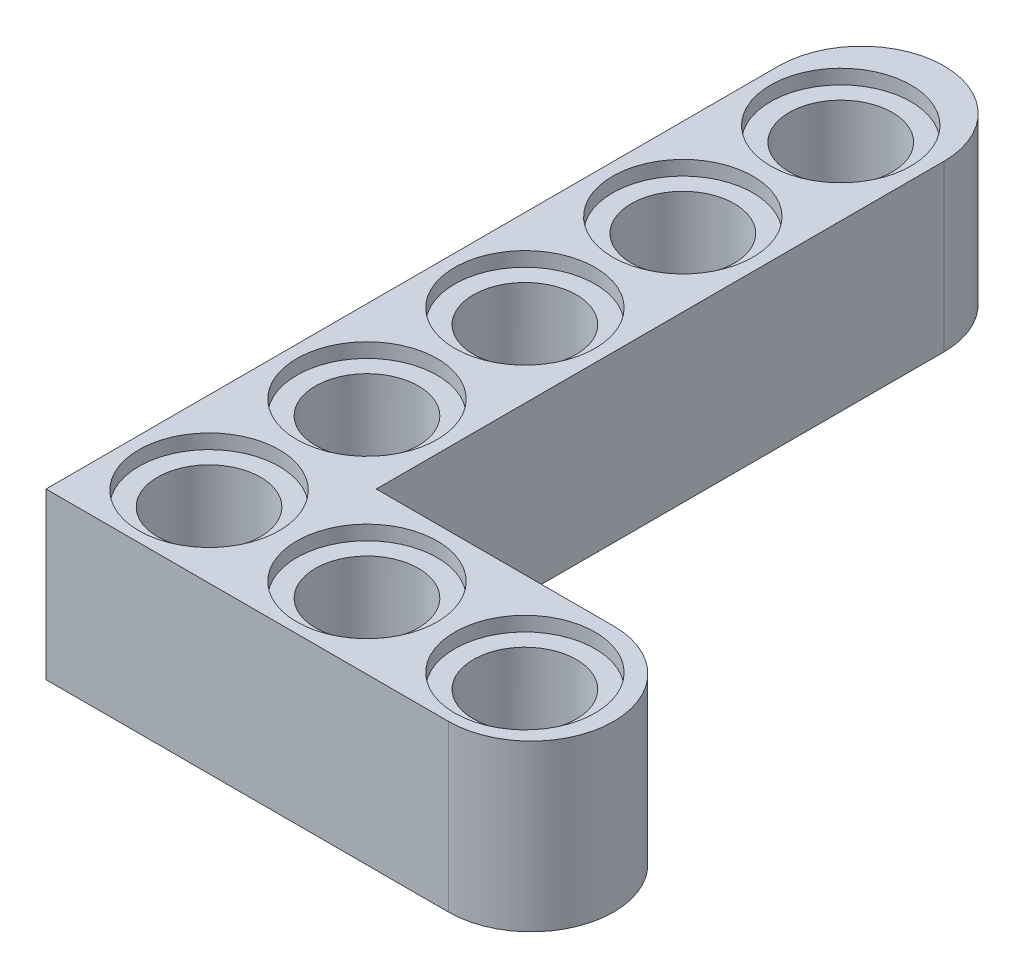
ISO-10303-21;
HEADER;
FILE_DESCRIPTION(('STEP AP214'),'2;1');
FILE_NAME('part.step','',(''),(''),'','','');
FILE_SCHEMA(('AUTOMOTIVE_DESIGN { 1 0 10303 214 1 1 1 1 }'));
ENDSEC;
DATA;
#1=APPLICATION_CONTEXT('core data for automotive mechanical design processes');
#2=APPLICATION_PROTOCOL_DEFINITION('international standard','automotive_design',2000,#1);
#3=PRODUCT_CONTEXT('',#1,'mechanical');
#4=PRODUCT('Part','Part','',(#3));
#5=PRODUCT_RELATED_PRODUCT_CATEGORY('part','',(#4));
#6=PRODUCT_DEFINITION_FORMATION('','',#4);
#7=PRODUCT_DEFINITION_CONTEXT('part definition',#1,'design');
#8=PRODUCT_DEFINITION('design','',#6,#7);
#9=PRODUCT_DEFINITION_SHAPE('','',#8);
#10=(LENGTH_UNIT() NAMED_UNIT(*) SI_UNIT(.MILLI.,.METRE.));
#11=(NAMED_UNIT(*) PLANE_ANGLE_UNIT() SI_UNIT($,.RADIAN.));
#12=(NAMED_UNIT(*) SI_UNIT($,.STERADIAN.) SOLID_ANGLE_UNIT());
#13=UNCERTAINTY_MEASURE_WITH_UNIT(LENGTH_MEASURE(1.E-05),#10,'distance_accuracy_value','');
#14=(GEOMETRIC_REPRESENTATION_CONTEXT(3) GLOBAL_UNCERTAINTY_ASSIGNED_CONTEXT((#13)) GLOBAL_UNIT_ASSIGNED_CONTEXT((#10,
#11,#12)) REPRESENTATION_CONTEXT('',''));
#15=CARTESIAN_POINT('',(0.,0.,0.));
#16=DIRECTION('',(0.,0.,1.));
#17=DIRECTION('',(1.,0.,0.));
#18=AXIS2_PLACEMENT_3D('',#15,#16,#17);
#19=CARTESIAN_POINT('',(11.5,8.,4.));
#20=DIRECTION('',(0.,-1.,0.));
#21=DIRECTION('',(0.,0.,-1.));
#22=AXIS2_PLACEMENT_3D('',#19,#20,#21);
#23=CYLINDRICAL_SURFACE('',#22,4.);
#24=DIRECTION('',(0.,-1.,0.));
#25=VECTOR('',#24,1.);
#26=CARTESIAN_POINT('',(11.5,8.,0.));
#27=LINE('',#26,#25);
#28=CARTESIAN_POINT('',(11.5,8.,0.));
#29=VERTEX_POINT('',#28);
#30=CARTESIAN_POINT('',(11.5,0.,0.));
#31=VERTEX_POINT('',#30);
#32=EDGE_CURVE('E178',#29,#31,#27,.T.);
#33=ORIENTED_EDGE('',*,*,#32,.F.);
#34=CARTESIAN_POINT('',(11.5,8.,4.));
#35=DIRECTION('',(0.,-1.,0.));
#36=DIRECTION('',(0.,0.,-1.));
#37=AXIS2_PLACEMENT_3D('',#34,#35,#36);
#38=CIRCLE('',#37,4.);
#39=CARTESIAN_POINT('',(11.5,8.,8.));
#40=VERTEX_POINT('',#39);
#41=EDGE_CURVE('E43',#40,#29,#38,.F.);
#42=ORIENTED_EDGE('',*,*,#41,.F.);
#43=DIRECTION('',(0.,-1.,0.));
#44=VECTOR('',#43,1.);
#45=CARTESIAN_POINT('',(11.5,8.,8.));
#46=LINE('',#45,#44);
#47=CARTESIAN_POINT('',(11.5,0.,8.));
#48=VERTEX_POINT('',#47);
#49=EDGE_CURVE('E109',#48,#40,#46,.F.);
#50=ORIENTED_EDGE('',*,*,#49,.F.);
#51=CARTESIAN_POINT('',(11.5,0.,4.));
#52=DIRECTION('',(0.,-1.,0.));
#53=DIRECTION('',(0.,0.,-1.));
#54=AXIS2_PLACEMENT_3D('',#51,#52,#53);
#55=CIRCLE('',#54,4.);
#56=EDGE_CURVE('E11',#31,#48,#55,.T.);
#57=ORIENTED_EDGE('',*,*,#56,.F.);
#58=EDGE_LOOP('',(#33,#42,#50,#57));
#59=FACE_BOUND('',#58,.T.);
#60=ADVANCED_FACE('F35',(#59),#23,.T.);
#61=CARTESIAN_POINT('',(-4.,0.,-27.5));
#62=DIRECTION('',(0.,-1.,0.));
#63=DIRECTION('',(0.,0.,-1.));
#64=AXIS2_PLACEMENT_3D('',#61,#62,#63);
#65=CYLINDRICAL_SURFACE('',#64,4.);
#66=DIRECTION('',(0.,-1.,0.));
#67=VECTOR('',#66,1.);
#68=CARTESIAN_POINT('',(0.,8.,-27.5));
#69=LINE('',#68,#67);
#70=CARTESIAN_POINT('',(0.,0.,-27.5));
#71=VERTEX_POINT('',#70);
#72=CARTESIAN_POINT('',(0.,8.,-27.5));
#73=VERTEX_POINT('',#72);
#74=EDGE_CURVE('E105',#71,#73,#69,.F.);
#75=ORIENTED_EDGE('',*,*,#74,.F.);
#76=CARTESIAN_POINT('',(-4.,0.,-27.5));
#77=DIRECTION('',(0.,-1.,0.));
#78=DIRECTION('',(0.,0.,-1.));
#79=AXIS2_PLACEMENT_3D('',#76,#77,#78);
#80=CIRCLE('',#79,4.);
#81=CARTESIAN_POINT('',(-8.,0.,-27.5));
#82=VERTEX_POINT('',#81);
#83=EDGE_CURVE('E175',#82,#71,#80,.T.);
#84=ORIENTED_EDGE('',*,*,#83,.F.);
#85=DIRECTION('',(0.,-1.,0.));
#86=VECTOR('',#85,1.);
#87=CARTESIAN_POINT('',(-8.,8.,-27.5));
#88=LINE('',#87,#86);
#89=CARTESIAN_POINT('',(-8.,8.,-27.5));
#90=VERTEX_POINT('',#89);
#91=EDGE_CURVE('E173',#90,#82,#88,.T.);
#92=ORIENTED_EDGE('',*,*,#91,.F.);
#93=CARTESIAN_POINT('',(-4.,8.,-27.5));
#94=DIRECTION('',(0.,-1.,0.));
#95=DIRECTION('',(0.,0.,-1.));
#96=AXIS2_PLACEMENT_3D('',#93,#94,#95);
#97=CIRCLE('',#96,4.);
#98=EDGE_CURVE('E92',#73,#90,#97,.F.);
#99=ORIENTED_EDGE('',*,*,#98,.F.);
#100=EDGE_LOOP('',(#75,#84,#92,#99));
#101=FACE_BOUND('',#100,.T.);
#102=ADVANCED_FACE('F191',(#101),#65,.T.);
#103=CARTESIAN_POINT('',(11.3000000000004,0.,4.10186368983272));
#104=DIRECTION('',(0.,1.,0.));
#105=DIRECTION('',(0.,0.,1.));
#106=AXIS2_PLACEMENT_3D('',#103,#104,#105);
#107=CYLINDRICAL_SURFACE('',#106,2.49663070763019);
#108=CARTESIAN_POINT('',(11.3000000000004,7.3,4.10186368983272));
#109=DIRECTION('',(0.,1.,0.));
#110=DIRECTION('',(0.,0.,1.));
#111=AXIS2_PLACEMENT_3D('',#108,#109,#110);
#112=CIRCLE('',#111,2.49663070763019);
#113=CARTESIAN_POINT('',(11.3000000000004,7.3,6.59849439746291));
#114=VERTEX_POINT('',#113);
#115=EDGE_CURVE('E119',#114,#114,#112,.F.);
#116=ORIENTED_EDGE('',*,*,#115,.F.);
#117=EDGE_LOOP('',(#116));
#118=FACE_BOUND('',#117,.T.);
#119=CARTESIAN_POINT('',(11.3000000000004,0.7,4.10186368983272));
#120=DIRECTION('',(0.,-1.,0.));
#121=DIRECTION('',(0.,0.,-1.));
#122=AXIS2_PLACEMENT_3D('',#119,#120,#121);
#123=CIRCLE('',#122,2.49663070763019);
#124=CARTESIAN_POINT('',(11.3000000000004,0.7,1.60523298220252));
#125=VERTEX_POINT('',#124);
#126=EDGE_CURVE('E167',#125,#125,#123,.F.);
#127=ORIENTED_EDGE('',*,*,#126,.F.);
#128=EDGE_LOOP('',(#127));
#129=FACE_BOUND('',#128,.T.);
#130=ADVANCED_FACE('F213',(#118,#129),#107,.F.);
#131=CARTESIAN_POINT('',(3.65000000000044,0.,4.10186368983272));
#132=DIRECTION('',(0.,1.,0.));
#133=DIRECTION('',(0.,0.,1.));
#134=AXIS2_PLACEMENT_3D('',#131,#132,#133);
#135=CYLINDRICAL_SURFACE('',#134,2.49663070763019);
#136=CARTESIAN_POINT('',(3.65000000000044,7.3,4.10186368983272));
#137=DIRECTION('',(0.,1.,0.));
#138=DIRECTION('',(0.,0.,1.));
#139=AXIS2_PLACEMENT_3D('',#136,#137,#138);
#140=CIRCLE('',#139,2.49663070763019);
#141=CARTESIAN_POINT('',(3.65000000000044,7.3,6.59849439746291));
#142=VERTEX_POINT('',#141);
#143=EDGE_CURVE('E143',#142,#142,#140,.F.);
#144=ORIENTED_EDGE('',*,*,#143,.F.);
#145=EDGE_LOOP('',(#144));
#146=FACE_BOUND('',#145,.T.);
#147=CARTESIAN_POINT('',(3.65000000000044,0.7,4.10186368983272));
#148=DIRECTION('',(0.,-1.,0.));
#149=DIRECTION('',(0.,0.,-1.));
#150=AXIS2_PLACEMENT_3D('',#147,#148,#149);
#151=CIRCLE('',#150,2.49663070763019);
#152=CARTESIAN_POINT('',(3.65000000000044,0.7,1.60523298220252));
#153=VERTEX_POINT('',#152);
#154=EDGE_CURVE('E164',#153,#153,#151,.F.);
#155=ORIENTED_EDGE('',*,*,#154,.F.);
#156=EDGE_LOOP('',(#155));
#157=FACE_BOUND('',#156,.T.);
#158=ADVANCED_FACE('F217',(#146,#157),#135,.F.);
#159=CARTESIAN_POINT('',(-3.99999999999956,0.,4.10186368983272));
#160=DIRECTION('',(0.,1.,0.));
#161=DIRECTION('',(0.,0.,1.));
#162=AXIS2_PLACEMENT_3D('',#159,#160,#161);
#163=CYLINDRICAL_SURFACE('',#162,2.49663070763019);
#164=CARTESIAN_POINT('',(-3.99999999999956,7.3,4.10186368983272));
#165=DIRECTION('',(0.,1.,0.));
#166=DIRECTION('',(0.,0.,1.));
#167=AXIS2_PLACEMENT_3D('',#164,#165,#166);
#168=CIRCLE('',#167,2.49663070763019);
#169=CARTESIAN_POINT('',(-3.99999999999956,7.3,6.59849439746291));
#170=VERTEX_POINT('',#169);
#171=EDGE_CURVE('E140',#170,#170,#168,.F.);
#172=ORIENTED_EDGE('',*,*,#171,.F.);
#173=EDGE_LOOP('',(#172));
#174=FACE_BOUND('',#173,.T.);
#175=CARTESIAN_POINT('',(-3.99999999999956,0.7,4.10186368983272));
#176=DIRECTION('',(0.,-1.,0.));
#177=DIRECTION('',(0.,0.,-1.));
#178=AXIS2_PLACEMENT_3D('',#175,#176,#177);
#179=CIRCLE('',#178,2.49663070763019);
#180=CARTESIAN_POINT('',(-3.99999999999956,0.7,1.60523298220252));
#181=VERTEX_POINT('',#180);
#182=EDGE_CURVE('E161',#181,#181,#179,.F.);
#183=ORIENTED_EDGE('',*,*,#182,.F.);
#184=EDGE_LOOP('',(#183));
#185=FACE_BOUND('',#184,.T.);
#186=ADVANCED_FACE('F408',(#174,#185),#163,.F.);
#187=CARTESIAN_POINT('',(-3.99999999999978,0.,-3.54813631016728));
#188=DIRECTION('',(0.,1.,0.));
#189=DIRECTION('',(0.,0.,1.));
#190=AXIS2_PLACEMENT_3D('',#187,#188,#189);
#191=CYLINDRICAL_SURFACE('',#190,2.49663070763019);
#192=CARTESIAN_POINT('',(-3.99999999999978,7.3,-3.54813631016728));
#193=DIRECTION('',(0.,1.,0.));
#194=DIRECTION('',(0.,0.,1.));
#195=AXIS2_PLACEMENT_3D('',#192,#193,#194);
#196=CIRCLE('',#195,2.49663070763019);
#197=CARTESIAN_POINT('',(-3.99999999999978,7.3,-1.05150560253709));
#198=VERTEX_POINT('',#197);
#199=EDGE_CURVE('E137',#198,#198,#196,.F.);
#200=ORIENTED_EDGE('',*,*,#199,.F.);
#201=EDGE_LOOP('',(#200));
#202=FACE_BOUND('',#201,.T.);
#203=CARTESIAN_POINT('',(-3.99999999999978,0.7,-3.54813631016728));
#204=DIRECTION('',(0.,-1.,0.));
#205=DIRECTION('',(0.,0.,-1.));
#206=AXIS2_PLACEMENT_3D('',#203,#204,#205);
#207=CIRCLE('',#206,2.49663070763019);
#208=CARTESIAN_POINT('',(-3.99999999999978,0.7,-6.04476701779748));
#209=VERTEX_POINT('',#208);
#210=EDGE_CURVE('E158',#209,#209,#207,.F.);
#211=ORIENTED_EDGE('',*,*,#210,.F.);
#212=EDGE_LOOP('',(#211));
#213=FACE_BOUND('',#212,.T.);
#214=ADVANCED_FACE('F399',(#202,#213),#191,.F.);
#215=CARTESIAN_POINT('',(-3.99999999999999,0.,-11.1981363101673));
#216=DIRECTION('',(0.,1.,0.));
#217=DIRECTION('',(0.,0.,1.));
#218=AXIS2_PLACEMENT_3D('',#215,#216,#217);
#219=CYLINDRICAL_SURFACE('',#218,2.49663070763019);
#220=CARTESIAN_POINT('',(-3.99999999999999,7.3,-11.1981363101673));
#221=DIRECTION('',(0.,1.,0.));
#222=DIRECTION('',(0.,0.,1.));
#223=AXIS2_PLACEMENT_3D('',#220,#221,#222);
#224=CIRCLE('',#223,2.49663070763019);
#225=CARTESIAN_POINT('',(-3.99999999999999,7.3,-8.70150560253709));
#226=VERTEX_POINT('',#225);
#227=EDGE_CURVE('E134',#226,#226,#224,.F.);
#228=ORIENTED_EDGE('',*,*,#227,.F.);
#229=EDGE_LOOP('',(#228));
#230=FACE_BOUND('',#229,.T.);
#231=CARTESIAN_POINT('',(-3.99999999999999,0.7,-11.1981363101673));
#232=DIRECTION('',(0.,-1.,0.));
#233=DIRECTION('',(0.,0.,-1.));
#234=AXIS2_PLACEMENT_3D('',#231,#232,#233);
#235=CIRCLE('',#234,2.49663070763019);
#236=CARTESIAN_POINT('',(-3.99999999999999,0.7,-13.6947670177975));
#237=VERTEX_POINT('',#236);
#238=EDGE_CURVE('E155',#237,#237,#235,.F.);
#239=ORIENTED_EDGE('',*,*,#238,.F.);
#240=EDGE_LOOP('',(#239));
#241=FACE_BOUND('',#240,.T.);
#242=ADVANCED_FACE('F390',(#230,#241),#219,.F.);
#243=CARTESIAN_POINT('',(-4.00000000000021,0.,-18.8481363101673));
#244=DIRECTION('',(0.,1.,0.));
#245=DIRECTION('',(0.,0.,1.));
#246=AXIS2_PLACEMENT_3D('',#243,#244,#245);
#247=CYLINDRICAL_SURFACE('',#246,2.49663070763019);
#248=CARTESIAN_POINT('',(-4.00000000000021,7.3,-18.8481363101673));
#249=DIRECTION('',(0.,1.,0.));
#250=DIRECTION('',(0.,0.,1.));
#251=AXIS2_PLACEMENT_3D('',#248,#249,#250);
#252=CIRCLE('',#251,2.49663070763019);
#253=CARTESIAN_POINT('',(-4.00000000000021,7.3,-16.3515056025371));
#254=VERTEX_POINT('',#253);
#255=EDGE_CURVE('E130',#254,#254,#252,.F.);
#256=ORIENTED_EDGE('',*,*,#255,.F.);
#257=EDGE_LOOP('',(#256));
#258=FACE_BOUND('',#257,.T.);
#259=CARTESIAN_POINT('',(-4.00000000000021,0.7,-18.8481363101673));
#260=DIRECTION('',(0.,-1.,0.));
#261=DIRECTION('',(0.,0.,-1.));
#262=AXIS2_PLACEMENT_3D('',#259,#260,#261);
#263=CIRCLE('',#262,2.49663070763019);
#264=CARTESIAN_POINT('',(-4.00000000000021,0.7,-21.3447670177975));
#265=VERTEX_POINT('',#264);
#266=EDGE_CURVE('E151',#265,#265,#263,.F.);
#267=ORIENTED_EDGE('',*,*,#266,.F.);
#268=EDGE_LOOP('',(#267));
#269=FACE_BOUND('',#268,.T.);
#270=ADVANCED_FACE('F380',(#258,#269),#247,.F.);
#271=CARTESIAN_POINT('',(-4.00000000000042,0.,-26.4981363101673));
#272=DIRECTION('',(0.,1.,0.));
#273=DIRECTION('',(0.,0.,1.));
#274=AXIS2_PLACEMENT_3D('',#271,#272,#273);
#275=CYLINDRICAL_SURFACE('',#274,2.49663070763019);
#276=CARTESIAN_POINT('',(-4.00000000000042,7.3,-26.4981363101673));
#277=DIRECTION('',(0.,1.,0.));
#278=DIRECTION('',(0.,0.,1.));
#279=AXIS2_PLACEMENT_3D('',#276,#277,#278);
#280=CIRCLE('',#279,2.49663070763019);
#281=CARTESIAN_POINT('',(-4.00000000000042,7.3,-24.0015056025371));
#282=VERTEX_POINT('',#281);
#283=EDGE_CURVE('E127',#282,#282,#280,.F.);
#284=ORIENTED_EDGE('',*,*,#283,.F.);
#285=EDGE_LOOP('',(#284));
#286=FACE_BOUND('',#285,.T.);
#287=CARTESIAN_POINT('',(-4.00000000000042,0.7,-26.4981363101673));
#288=DIRECTION('',(0.,-1.,0.));
#289=DIRECTION('',(0.,0.,-1.));
#290=AXIS2_PLACEMENT_3D('',#287,#288,#289);
#291=CIRCLE('',#290,2.49663070763019);
#292=CARTESIAN_POINT('',(-4.00000000000042,0.7,-28.9947670177975));
#293=VERTEX_POINT('',#292);
#294=EDGE_CURVE('E148',#293,#293,#291,.F.);
#295=ORIENTED_EDGE('',*,*,#294,.F.);
#296=EDGE_LOOP('',(#295));
#297=FACE_BOUND('',#296,.T.);
#298=ADVANCED_FACE('F226',(#286,#297),#275,.F.);
#299=CARTESIAN_POINT('',(-8.00000000000001,8.,8.00000000000001));
#300=DIRECTION('',(1.,0.,0.));
#301=DIRECTION('',(0.,0.,-1.));
#302=AXIS2_PLACEMENT_3D('',#299,#300,#301);
#303=PLANE('',#302);
#304=DIRECTION('',(0.,0.,1.));
#305=VECTOR('',#304,1.);
#306=CARTESIAN_POINT('',(-8.00000000000001,8.,8.00000000000001));
#307=LINE('',#306,#305);
#308=CARTESIAN_POINT('',(-8.00000000000001,8.,8.00000000000001));
#309=VERTEX_POINT('',#308);
#310=EDGE_CURVE('E86',#90,#309,#307,.T.);
#311=ORIENTED_EDGE('',*,*,#310,.F.);
#312=ORIENTED_EDGE('',*,*,#91,.T.);
#313=DIRECTION('',(0.,0.,1.));
#314=VECTOR('',#313,1.);
#315=CARTESIAN_POINT('',(-8.00000000000001,0.,8.00000000000001));
#316=LINE('',#315,#314);
#317=CARTESIAN_POINT('',(-8.00000000000001,0.,8.00000000000001));
#318=VERTEX_POINT('',#317);
#319=EDGE_CURVE('E102',#82,#318,#316,.T.);
#320=ORIENTED_EDGE('',*,*,#319,.T.);
#321=DIRECTION('',(0.,-1.,0.));
#322=VECTOR('',#321,1.);
#323=CARTESIAN_POINT('',(-8.00000000000001,8.,8.00000000000001));
#324=LINE('',#323,#322);
#325=EDGE_CURVE('E99',#309,#318,#324,.T.);
#326=ORIENTED_EDGE('',*,*,#325,.F.);
#327=EDGE_LOOP('',(#311,#312,#320,#326));
#328=FACE_BOUND('',#327,.T.);
#329=ADVANCED_FACE('F100',(#328),#303,.F.);
#330=CARTESIAN_POINT('',(15.5,8.,8.));
#331=DIRECTION('',(0.,0.,-1.));
#332=DIRECTION('',(-1.,0.,0.));
#333=AXIS2_PLACEMENT_3D('',#330,#331,#332);
#334=PLANE('',#333);
#335=DIRECTION('',(1.,0.,0.));
#336=VECTOR('',#335,1.);
#337=CARTESIAN_POINT('',(15.5,0.,8.));
#338=LINE('',#337,#336);
#339=EDGE_CURVE('E118',#318,#48,#338,.T.);
#340=ORIENTED_EDGE('',*,*,#339,.T.);
#341=ORIENTED_EDGE('',*,*,#49,.T.);
#342=DIRECTION('',(1.,0.,0.));
#343=VECTOR('',#342,1.);
#344=CARTESIAN_POINT('',(15.5,8.,8.));
#345=LINE('',#344,#343);
#346=EDGE_CURVE('E90',#309,#40,#345,.T.);
#347=ORIENTED_EDGE('',*,*,#346,.F.);
#348=ORIENTED_EDGE('',*,*,#325,.T.);
#349=EDGE_LOOP('',(#340,#341,#347,#348));
#350=FACE_BOUND('',#349,.T.);
#351=ADVANCED_FACE('F108',(#350),#334,.F.);
#352=CARTESIAN_POINT('',(0.,8.,0.));
#353=DIRECTION('',(0.,0.,1.));
#354=DIRECTION('',(1.,0.,0.));
#355=AXIS2_PLACEMENT_3D('',#352,#353,#354);
#356=PLANE('',#355);
#357=DIRECTION('',(-1.,0.,0.));
#358=VECTOR('',#357,1.);
#359=CARTESIAN_POINT('',(0.,8.,0.));
#360=LINE('',#359,#358);
#361=CARTESIAN_POINT('',(0.,8.,0.));
#362=VERTEX_POINT('',#361);
#363=EDGE_CURVE('E110',#29,#362,#360,.T.);
#364=ORIENTED_EDGE('',*,*,#363,.F.);
#365=ORIENTED_EDGE('',*,*,#32,.T.);
#366=DIRECTION('',(-1.,0.,0.));
#367=VECTOR('',#366,1.);
#368=CARTESIAN_POINT('',(0.,0.,0.));
#369=LINE('',#368,#367);
#370=CARTESIAN_POINT('',(0.,0.,0.));
#371=VERTEX_POINT('',#370);
#372=EDGE_CURVE('E121',#31,#371,#369,.T.);
#373=ORIENTED_EDGE('',*,*,#372,.T.);
#374=DIRECTION('',(0.,-1.,0.));
#375=VECTOR('',#374,1.);
#376=CARTESIAN_POINT('',(0.,8.,0.));
#377=LINE('',#376,#375);
#378=EDGE_CURVE('E106',#362,#371,#377,.T.);
#379=ORIENTED_EDGE('',*,*,#378,.F.);
#380=EDGE_LOOP('',(#364,#365,#373,#379));
#381=FACE_BOUND('',#380,.T.);
#382=ADVANCED_FACE('F184',(#381),#356,.F.);
#383=CARTESIAN_POINT('',(0.,8.,-31.5));
#384=DIRECTION('',(-1.,0.,0.));
#385=DIRECTION('',(0.,0.,1.));
#386=AXIS2_PLACEMENT_3D('',#383,#384,#385);
#387=PLANE('',#386);
#388=DIRECTION('',(0.,0.,-1.));
#389=VECTOR('',#388,1.);
#390=CARTESIAN_POINT('',(0.,0.,-31.5));
#391=LINE('',#390,#389);
#392=EDGE_CURVE('E96',#371,#71,#391,.T.);
#393=ORIENTED_EDGE('',*,*,#392,.T.);
#394=ORIENTED_EDGE('',*,*,#74,.T.);
#395=DIRECTION('',(0.,0.,-1.));
#396=VECTOR('',#395,1.);
#397=CARTESIAN_POINT('',(0.,8.,-31.5));
#398=LINE('',#397,#396);
#399=EDGE_CURVE('E112',#362,#73,#398,.T.);
#400=ORIENTED_EDGE('',*,*,#399,.F.);
#401=ORIENTED_EDGE('',*,*,#378,.T.);
#402=EDGE_LOOP('',(#393,#394,#400,#401));
#403=FACE_BOUND('',#402,.T.);
#404=ADVANCED_FACE('F188',(#403),#387,.F.);
#405=CARTESIAN_POINT('',(0.,8.,0.));
#406=DIRECTION('',(0.,-1.,0.));
#407=DIRECTION('',(0.,0.,-1.));
#408=AXIS2_PLACEMENT_3D('',#405,#406,#407);
#409=PLANE('',#408);
#410=CARTESIAN_POINT('',(-4.00000000000042,8.,-26.4981363101673));
#411=DIRECTION('',(0.,1.,0.));
#412=DIRECTION('',(0.,0.,1.));
#413=AXIS2_PLACEMENT_3D('',#410,#411,#412);
#414=CIRCLE('',#413,3.4);
#415=CARTESIAN_POINT('',(-4.00000000000042,8.,-23.0981363101673));
#416=VERTEX_POINT('',#415);
#417=EDGE_CURVE('E631',#416,#416,#414,.T.);
#418=ORIENTED_EDGE('',*,*,#417,.F.);
#419=EDGE_LOOP('',(#418));
#420=FACE_BOUND('',#419,.T.);
#421=CARTESIAN_POINT('',(-4.0000000000001,8.,-18.8481363101673));
#422=DIRECTION('',(0.,1.,0.));
#423=DIRECTION('',(0.,0.,1.));
#424=AXIS2_PLACEMENT_3D('',#421,#422,#423);
#425=CIRCLE('',#424,3.4);
#426=CARTESIAN_POINT('',(-4.0000000000001,8.,-15.4481363101673));
#427=VERTEX_POINT('',#426);
#428=EDGE_CURVE('E637',#427,#427,#425,.T.);
#429=ORIENTED_EDGE('',*,*,#428,.F.);
#430=EDGE_LOOP('',(#429));
#431=FACE_BOUND('',#430,.T.);
#432=CARTESIAN_POINT('',(-3.99999999999977,8.,-11.1981363101673));
#433=DIRECTION('',(0.,1.,0.));
#434=DIRECTION('',(0.,0.,1.));
#435=AXIS2_PLACEMENT_3D('',#432,#433,#434);
#436=CIRCLE('',#435,3.4);
#437=CARTESIAN_POINT('',(-3.99999999999977,8.,-7.79813631016729));
#438=VERTEX_POINT('',#437);
#439=EDGE_CURVE('E643',#438,#438,#436,.T.);
#440=ORIENTED_EDGE('',*,*,#439,.F.);
#441=EDGE_LOOP('',(#440));
#442=FACE_BOUND('',#441,.T.);
#443=CARTESIAN_POINT('',(-3.99999999999945,8.,-3.54813631016728));
#444=DIRECTION('',(0.,1.,0.));
#445=DIRECTION('',(0.,0.,1.));
#446=AXIS2_PLACEMENT_3D('',#443,#444,#445);
#447=CIRCLE('',#446,3.4);
#448=CARTESIAN_POINT('',(-3.99999999999945,8.,-0.148136310167285));
#449=VERTEX_POINT('',#448);
#450=EDGE_CURVE('E649',#449,#449,#447,.T.);
#451=ORIENTED_EDGE('',*,*,#450,.F.);
#452=EDGE_LOOP('',(#451));
#453=FACE_BOUND('',#452,.T.);
#454=CARTESIAN_POINT('',(-3.99999999999913,8.,4.10186368983272));
#455=DIRECTION('',(0.,1.,0.));
#456=DIRECTION('',(0.,0.,1.));
#457=AXIS2_PLACEMENT_3D('',#454,#455,#456);
#458=CIRCLE('',#457,3.4);
#459=CARTESIAN_POINT('',(-3.99999999999913,8.,7.50186368983272));
#460=VERTEX_POINT('',#459);
#461=EDGE_CURVE('E655',#460,#460,#458,.T.);
#462=ORIENTED_EDGE('',*,*,#461,.F.);
#463=EDGE_LOOP('',(#462));
#464=FACE_BOUND('',#463,.T.);
#465=CARTESIAN_POINT('',(3.65000000000044,8.,4.10186368983272));
#466=DIRECTION('',(0.,1.,0.));
#467=DIRECTION('',(0.,0.,1.));
#468=AXIS2_PLACEMENT_3D('',#465,#466,#467);
#469=CIRCLE('',#468,3.4);
#470=CARTESIAN_POINT('',(3.65000000000044,8.,7.50186368983272));
#471=VERTEX_POINT('',#470);
#472=EDGE_CURVE('E661',#471,#471,#469,.T.);
#473=ORIENTED_EDGE('',*,*,#472,.F.);
#474=EDGE_LOOP('',(#473));
#475=FACE_BOUND('',#474,.T.);
#476=CARTESIAN_POINT('',(11.3,8.,4.10186368983272));
#477=DIRECTION('',(0.,1.,0.));
#478=DIRECTION('',(0.,0.,1.));
#479=AXIS2_PLACEMENT_3D('',#476,#477,#478);
#480=CIRCLE('',#479,3.4);
#481=CARTESIAN_POINT('',(11.3,8.,7.50186368983272));
#482=VERTEX_POINT('',#481);
#483=EDGE_CURVE('E170',#482,#482,#480,.T.);
#484=ORIENTED_EDGE('',*,*,#483,.F.);
#485=EDGE_LOOP('',(#484));
#486=FACE_BOUND('',#485,.T.);
#487=ORIENTED_EDGE('',*,*,#346,.T.);
#488=ORIENTED_EDGE('',*,*,#41,.T.);
#489=ORIENTED_EDGE('',*,*,#363,.T.);
#490=ORIENTED_EDGE('',*,*,#399,.T.);
#491=ORIENTED_EDGE('',*,*,#98,.T.);
#492=ORIENTED_EDGE('',*,*,#310,.T.);
#493=EDGE_LOOP('',(#487,#488,#489,#490,#491,#492));
#494=FACE_BOUND('',#493,.T.);
#495=ADVANCED_FACE('F88',(#420,#431,#442,#453,#464,#475,#486,#494),#409,.F.);
#496=CARTESIAN_POINT('',(0.,0.,0.));
#497=DIRECTION('',(0.,-1.,0.));
#498=DIRECTION('',(0.,0.,-1.));
#499=AXIS2_PLACEMENT_3D('',#496,#497,#498);
#500=PLANE('',#499);
#501=CARTESIAN_POINT('',(-4.,0.,-26.4981363101673));
#502=DIRECTION('',(0.,-1.,0.));
#503=DIRECTION('',(0.,0.,-1.));
#504=AXIS2_PLACEMENT_3D('',#501,#502,#503);
#505=CIRCLE('',#504,3.4);
#506=CARTESIAN_POINT('',(-4.,0.,-29.8981363101673));
#507=VERTEX_POINT('',#506);
#508=EDGE_CURVE('E617',#507,#507,#505,.T.);
#509=ORIENTED_EDGE('',*,*,#508,.F.);
#510=EDGE_LOOP('',(#509));
#511=FACE_BOUND('',#510,.T.);
#512=CARTESIAN_POINT('',(-3.99999999999989,0.,-18.8481363101673));
#513=DIRECTION('',(0.,-1.,0.));
#514=DIRECTION('',(0.,0.,-1.));
#515=AXIS2_PLACEMENT_3D('',#512,#513,#514);
#516=CIRCLE('',#515,3.4);
#517=CARTESIAN_POINT('',(-3.99999999999989,0.,-22.2481363101673));
#518=VERTEX_POINT('',#517);
#519=EDGE_CURVE('E619',#518,#518,#516,.T.);
#520=ORIENTED_EDGE('',*,*,#519,.F.);
#521=EDGE_LOOP('',(#520));
#522=FACE_BOUND('',#521,.T.);
#523=CARTESIAN_POINT('',(-3.99999999999978,0.,-11.1981363101673));
#524=DIRECTION('',(0.,-1.,0.));
#525=DIRECTION('',(0.,0.,-1.));
#526=AXIS2_PLACEMENT_3D('',#523,#524,#525);
#527=CIRCLE('',#526,3.4);
#528=CARTESIAN_POINT('',(-3.99999999999978,0.,-14.5981363101673));
#529=VERTEX_POINT('',#528);
#530=EDGE_CURVE('E753',#529,#529,#527,.T.);
#531=ORIENTED_EDGE('',*,*,#530,.F.);
#532=EDGE_LOOP('',(#531));
#533=FACE_BOUND('',#532,.T.);
#534=CARTESIAN_POINT('',(-3.99999999999967,0.,-3.54813631016728));
#535=DIRECTION('',(0.,-1.,0.));
#536=DIRECTION('',(0.,0.,-1.));
#537=AXIS2_PLACEMENT_3D('',#534,#535,#536);
#538=CIRCLE('',#537,3.4);
#539=CARTESIAN_POINT('',(-3.99999999999967,0.,-6.94813631016728));
#540=VERTEX_POINT('',#539);
#541=EDGE_CURVE('E747',#540,#540,#538,.T.);
#542=ORIENTED_EDGE('',*,*,#541,.F.);
#543=EDGE_LOOP('',(#542));
#544=FACE_BOUND('',#543,.T.);
#545=CARTESIAN_POINT('',(11.3000000000004,0.,4.10186368983272));
#546=DIRECTION('',(0.,-1.,0.));
#547=DIRECTION('',(0.,0.,-1.));
#548=AXIS2_PLACEMENT_3D('',#545,#546,#547);
#549=CIRCLE('',#548,3.4);
#550=CARTESIAN_POINT('',(11.3000000000004,0.,0.701863689832715));
#551=VERTEX_POINT('',#550);
#552=EDGE_CURVE('E741',#551,#551,#549,.T.);
#553=ORIENTED_EDGE('',*,*,#552,.F.);
#554=EDGE_LOOP('',(#553));
#555=FACE_BOUND('',#554,.T.);
#556=CARTESIAN_POINT('',(3.65000000000044,0.,4.10186368983272));
#557=DIRECTION('',(0.,-1.,0.));
#558=DIRECTION('',(0.,0.,-1.));
#559=AXIS2_PLACEMENT_3D('',#556,#557,#558);
#560=CIRCLE('',#559,3.4);
#561=CARTESIAN_POINT('',(3.65000000000044,0.,0.701863689832716));
#562=VERTEX_POINT('',#561);
#563=EDGE_CURVE('E732',#562,#562,#560,.T.);
#564=ORIENTED_EDGE('',*,*,#563,.F.);
#565=EDGE_LOOP('',(#564));
#566=FACE_BOUND('',#565,.T.);
#567=CARTESIAN_POINT('',(-3.99999999999956,0.,4.10186368983272));
#568=DIRECTION('',(0.,-1.,0.));
#569=DIRECTION('',(0.,0.,-1.));
#570=AXIS2_PLACEMENT_3D('',#567,#568,#569);
#571=CIRCLE('',#570,3.4);
#572=CARTESIAN_POINT('',(-3.99999999999956,0.,0.701863689832716));
#573=VERTEX_POINT('',#572);
#574=EDGE_CURVE('E625',#573,#573,#571,.T.);
#575=ORIENTED_EDGE('',*,*,#574,.F.);
#576=EDGE_LOOP('',(#575));
#577=FACE_BOUND('',#576,.T.);
#578=ORIENTED_EDGE('',*,*,#372,.F.);
#579=ORIENTED_EDGE('',*,*,#56,.T.);
#580=ORIENTED_EDGE('',*,*,#339,.F.);
#581=ORIENTED_EDGE('',*,*,#319,.F.);
#582=ORIENTED_EDGE('',*,*,#83,.T.);
#583=ORIENTED_EDGE('',*,*,#392,.F.);
#584=EDGE_LOOP('',(#578,#579,#580,#581,#582,#583));
#585=FACE_BOUND('',#584,.T.);
#586=ADVANCED_FACE('F192',(#511,#522,#533,#544,#555,#566,#577,#585),#500,.T.);
#587=CARTESIAN_POINT('',(-4.00000000000042,7.3,-26.4981363101673));
#588=DIRECTION('',(0.,1.,0.));
#589=DIRECTION('',(0.,0.,1.));
#590=AXIS2_PLACEMENT_3D('',#587,#588,#589);
#591=PLANE('',#590);
#592=CARTESIAN_POINT('',(-4.00000000000042,7.3,-26.4981363101673));
#593=DIRECTION('',(0.,1.,0.));
#594=DIRECTION('',(0.,0.,1.));
#595=AXIS2_PLACEMENT_3D('',#592,#593,#594);
#596=CIRCLE('',#595,3.4);
#597=CARTESIAN_POINT('',(-4.00000000000042,7.3,-23.0981363101673));
#598=VERTEX_POINT('',#597);
#599=EDGE_CURVE('E131',#598,#598,#596,.T.);
#600=ORIENTED_EDGE('',*,*,#599,.T.);
#601=EDGE_LOOP('',(#600));
#602=FACE_BOUND('',#601,.T.);
#603=ORIENTED_EDGE('',*,*,#283,.T.);
#604=EDGE_LOOP('',(#603));
#605=FACE_BOUND('',#604,.T.);
#606=ADVANCED_FACE('F194',(#602,#605),#591,.T.);
#607=CARTESIAN_POINT('',(-4.00000000000042,7.3,-26.4981363101673));
#608=DIRECTION('',(0.,1.,0.));
#609=DIRECTION('',(0.,0.,1.));
#610=AXIS2_PLACEMENT_3D('',#607,#608,#609);
#611=CYLINDRICAL_SURFACE('',#610,3.4);
#612=ORIENTED_EDGE('',*,*,#599,.F.);
#613=EDGE_LOOP('',(#612));
#614=FACE_BOUND('',#613,.T.);
#615=ORIENTED_EDGE('',*,*,#417,.T.);
#616=EDGE_LOOP('',(#615));
#617=FACE_BOUND('',#616,.T.);
#618=ADVANCED_FACE('F201',(#614,#617),#611,.F.);
#619=CARTESIAN_POINT('',(-4.0000000000001,7.3,-18.8481363101673));
#620=DIRECTION('',(0.,1.,0.));
#621=DIRECTION('',(0.,0.,1.));
#622=AXIS2_PLACEMENT_3D('',#619,#620,#621);
#623=PLANE('',#622);
#624=CARTESIAN_POINT('',(-4.0000000000001,7.3,-18.8481363101673));
#625=DIRECTION('',(0.,1.,0.));
#626=DIRECTION('',(0.,0.,1.));
#627=AXIS2_PLACEMENT_3D('',#624,#625,#626);
#628=CIRCLE('',#627,3.4);
#629=CARTESIAN_POINT('',(-4.0000000000001,7.3,-15.4481363101673));
#630=VERTEX_POINT('',#629);
#631=EDGE_CURVE('E634',#630,#630,#628,.T.);
#632=ORIENTED_EDGE('',*,*,#631,.T.);
#633=EDGE_LOOP('',(#632));
#634=FACE_BOUND('',#633,.T.);
#635=ORIENTED_EDGE('',*,*,#255,.T.);
#636=EDGE_LOOP('',(#635));
#637=FACE_BOUND('',#636,.T.);
#638=ADVANCED_FACE('F262',(#634,#637),#623,.T.);
#639=CARTESIAN_POINT('',(-4.0000000000001,7.3,-18.8481363101673));
#640=DIRECTION('',(0.,1.,0.));
#641=DIRECTION('',(0.,0.,1.));
#642=AXIS2_PLACEMENT_3D('',#639,#640,#641);
#643=CYLINDRICAL_SURFACE('',#642,3.4);
#644=ORIENTED_EDGE('',*,*,#631,.F.);
#645=EDGE_LOOP('',(#644));
#646=FACE_BOUND('',#645,.T.);
#647=ORIENTED_EDGE('',*,*,#428,.T.);
#648=EDGE_LOOP('',(#647));
#649=FACE_BOUND('',#648,.T.);
#650=ADVANCED_FACE('F271',(#646,#649),#643,.F.);
#651=CARTESIAN_POINT('',(-3.99999999999977,7.3,-11.1981363101673));
#652=DIRECTION('',(0.,1.,0.));
#653=DIRECTION('',(0.,0.,1.));
#654=AXIS2_PLACEMENT_3D('',#651,#652,#653);
#655=PLANE('',#654);
#656=CARTESIAN_POINT('',(-3.99999999999977,7.3,-11.1981363101673));
#657=DIRECTION('',(0.,1.,0.));
#658=DIRECTION('',(0.,0.,1.));
#659=AXIS2_PLACEMENT_3D('',#656,#657,#658);
#660=CIRCLE('',#659,3.4);
#661=CARTESIAN_POINT('',(-3.99999999999977,7.3,-7.79813631016729));
#662=VERTEX_POINT('',#661);
#663=EDGE_CURVE('E640',#662,#662,#660,.T.);
#664=ORIENTED_EDGE('',*,*,#663,.T.);
#665=EDGE_LOOP('',(#664));
#666=FACE_BOUND('',#665,.T.);
#667=ORIENTED_EDGE('',*,*,#227,.T.);
#668=EDGE_LOOP('',(#667));
#669=FACE_BOUND('',#668,.T.);
#670=ADVANCED_FACE('F280',(#666,#669),#655,.T.);
#671=CARTESIAN_POINT('',(-3.99999999999977,7.3,-11.1981363101673));
#672=DIRECTION('',(0.,1.,0.));
#673=DIRECTION('',(0.,0.,1.));
#674=AXIS2_PLACEMENT_3D('',#671,#672,#673);
#675=CYLINDRICAL_SURFACE('',#674,3.4);
#676=ORIENTED_EDGE('',*,*,#663,.F.);
#677=EDGE_LOOP('',(#676));
#678=FACE_BOUND('',#677,.T.);
#679=ORIENTED_EDGE('',*,*,#439,.T.);
#680=EDGE_LOOP('',(#679));
#681=FACE_BOUND('',#680,.T.);
#682=ADVANCED_FACE('F289',(#678,#681),#675,.F.);
#683=CARTESIAN_POINT('',(-3.99999999999945,7.3,-3.54813631016728));
#684=DIRECTION('',(0.,1.,0.));
#685=DIRECTION('',(0.,0.,1.));
#686=AXIS2_PLACEMENT_3D('',#683,#684,#685);
#687=PLANE('',#686);
#688=CARTESIAN_POINT('',(-3.99999999999945,7.3,-3.54813631016728));
#689=DIRECTION('',(0.,1.,0.));
#690=DIRECTION('',(0.,0.,1.));
#691=AXIS2_PLACEMENT_3D('',#688,#689,#690);
#692=CIRCLE('',#691,3.4);
#693=CARTESIAN_POINT('',(-3.99999999999945,7.3,-0.148136310167285));
#694=VERTEX_POINT('',#693);
#695=EDGE_CURVE('E646',#694,#694,#692,.T.);
#696=ORIENTED_EDGE('',*,*,#695,.T.);
#697=EDGE_LOOP('',(#696));
#698=FACE_BOUND('',#697,.T.);
#699=ORIENTED_EDGE('',*,*,#199,.T.);
#700=EDGE_LOOP('',(#699));
#701=FACE_BOUND('',#700,.T.);
#702=ADVANCED_FACE('F298',(#698,#701),#687,.T.);
#703=CARTESIAN_POINT('',(-3.99999999999945,7.3,-3.54813631016728));
#704=DIRECTION('',(0.,1.,0.));
#705=DIRECTION('',(0.,0.,1.));
#706=AXIS2_PLACEMENT_3D('',#703,#704,#705);
#707=CYLINDRICAL_SURFACE('',#706,3.4);
#708=ORIENTED_EDGE('',*,*,#695,.F.);
#709=EDGE_LOOP('',(#708));
#710=FACE_BOUND('',#709,.T.);
#711=ORIENTED_EDGE('',*,*,#450,.T.);
#712=EDGE_LOOP('',(#711));
#713=FACE_BOUND('',#712,.T.);
#714=ADVANCED_FACE('F307',(#710,#713),#707,.F.);
#715=CARTESIAN_POINT('',(-3.99999999999913,7.3,4.10186368983272));
#716=DIRECTION('',(0.,1.,0.));
#717=DIRECTION('',(0.,0.,1.));
#718=AXIS2_PLACEMENT_3D('',#715,#716,#717);
#719=PLANE('',#718);
#720=CARTESIAN_POINT('',(-3.99999999999913,7.3,4.10186368983272));
#721=DIRECTION('',(0.,1.,0.));
#722=DIRECTION('',(0.,0.,1.));
#723=AXIS2_PLACEMENT_3D('',#720,#721,#722);
#724=CIRCLE('',#723,3.4);
#725=CARTESIAN_POINT('',(-3.99999999999913,7.3,7.50186368983272));
#726=VERTEX_POINT('',#725);
#727=EDGE_CURVE('E652',#726,#726,#724,.T.);
#728=ORIENTED_EDGE('',*,*,#727,.T.);
#729=EDGE_LOOP('',(#728));
#730=FACE_BOUND('',#729,.T.);
#731=ORIENTED_EDGE('',*,*,#171,.T.);
#732=EDGE_LOOP('',(#731));
#733=FACE_BOUND('',#732,.T.);
#734=ADVANCED_FACE('F316',(#730,#733),#719,.T.);
#735=CARTESIAN_POINT('',(-3.99999999999913,7.3,4.10186368983272));
#736=DIRECTION('',(0.,1.,0.));
#737=DIRECTION('',(0.,0.,1.));
#738=AXIS2_PLACEMENT_3D('',#735,#736,#737);
#739=CYLINDRICAL_SURFACE('',#738,3.4);
#740=ORIENTED_EDGE('',*,*,#727,.F.);
#741=EDGE_LOOP('',(#740));
#742=FACE_BOUND('',#741,.T.);
#743=ORIENTED_EDGE('',*,*,#461,.T.);
#744=EDGE_LOOP('',(#743));
#745=FACE_BOUND('',#744,.T.);
#746=ADVANCED_FACE('F325',(#742,#745),#739,.F.);
#747=CARTESIAN_POINT('',(3.65000000000044,7.3,4.10186368983272));
#748=DIRECTION('',(0.,1.,0.));
#749=DIRECTION('',(0.,0.,1.));
#750=AXIS2_PLACEMENT_3D('',#747,#748,#749);
#751=PLANE('',#750);
#752=CARTESIAN_POINT('',(3.65000000000044,7.3,4.10186368983272));
#753=DIRECTION('',(0.,1.,0.));
#754=DIRECTION('',(0.,0.,1.));
#755=AXIS2_PLACEMENT_3D('',#752,#753,#754);
#756=CIRCLE('',#755,3.4);
#757=CARTESIAN_POINT('',(3.65000000000044,7.3,7.50186368983272));
#758=VERTEX_POINT('',#757);
#759=EDGE_CURVE('E658',#758,#758,#756,.T.);
#760=ORIENTED_EDGE('',*,*,#759,.T.);
#761=EDGE_LOOP('',(#760));
#762=FACE_BOUND('',#761,.T.);
#763=ORIENTED_EDGE('',*,*,#143,.T.);
#764=EDGE_LOOP('',(#763));
#765=FACE_BOUND('',#764,.T.);
#766=ADVANCED_FACE('F334',(#762,#765),#751,.T.);
#767=CARTESIAN_POINT('',(3.65000000000044,7.3,4.10186368983272));
#768=DIRECTION('',(0.,1.,0.));
#769=DIRECTION('',(0.,0.,1.));
#770=AXIS2_PLACEMENT_3D('',#767,#768,#769);
#771=CYLINDRICAL_SURFACE('',#770,3.4);
#772=ORIENTED_EDGE('',*,*,#759,.F.);
#773=EDGE_LOOP('',(#772));
#774=FACE_BOUND('',#773,.T.);
#775=ORIENTED_EDGE('',*,*,#472,.T.);
#776=EDGE_LOOP('',(#775));
#777=FACE_BOUND('',#776,.T.);
#778=ADVANCED_FACE('F343',(#774,#777),#771,.F.);
#779=CARTESIAN_POINT('',(11.3,7.3,4.10186368983272));
#780=DIRECTION('',(0.,1.,0.));
#781=DIRECTION('',(0.,0.,1.));
#782=AXIS2_PLACEMENT_3D('',#779,#780,#781);
#783=PLANE('',#782);
#784=CARTESIAN_POINT('',(11.3,7.3,4.10186368983272));
#785=DIRECTION('',(0.,1.,0.));
#786=DIRECTION('',(0.,0.,1.));
#787=AXIS2_PLACEMENT_3D('',#784,#785,#786);
#788=CIRCLE('',#787,3.4);
#789=CARTESIAN_POINT('',(11.3,7.3,7.50186368983272));
#790=VERTEX_POINT('',#789);
#791=EDGE_CURVE('E664',#790,#790,#788,.T.);
#792=ORIENTED_EDGE('',*,*,#791,.T.);
#793=EDGE_LOOP('',(#792));
#794=FACE_BOUND('',#793,.T.);
#795=ORIENTED_EDGE('',*,*,#115,.T.);
#796=EDGE_LOOP('',(#795));
#797=FACE_BOUND('',#796,.T.);
#798=ADVANCED_FACE('F352',(#794,#797),#783,.T.);
#799=CARTESIAN_POINT('',(11.3,7.3,4.10186368983272));
#800=DIRECTION('',(0.,1.,0.));
#801=DIRECTION('',(0.,0.,1.));
#802=AXIS2_PLACEMENT_3D('',#799,#800,#801);
#803=CYLINDRICAL_SURFACE('',#802,3.4);
#804=ORIENTED_EDGE('',*,*,#791,.F.);
#805=EDGE_LOOP('',(#804));
#806=FACE_BOUND('',#805,.T.);
#807=ORIENTED_EDGE('',*,*,#483,.T.);
#808=EDGE_LOOP('',(#807));
#809=FACE_BOUND('',#808,.T.);
#810=ADVANCED_FACE('F361',(#806,#809),#803,.F.);
#811=CARTESIAN_POINT('',(-3.99999999999956,0.7,4.10186368983272));
#812=DIRECTION('',(0.,-1.,0.));
#813=DIRECTION('',(0.,0.,-1.));
#814=AXIS2_PLACEMENT_3D('',#811,#812,#813);
#815=PLANE('',#814);
#816=CARTESIAN_POINT('',(-3.99999999999956,0.7,4.10186368983272));
#817=DIRECTION('',(0.,-1.,0.));
#818=DIRECTION('',(0.,0.,-1.));
#819=AXIS2_PLACEMENT_3D('',#816,#817,#818);
#820=CIRCLE('',#819,3.4);
#821=CARTESIAN_POINT('',(-3.99999999999956,0.7,0.701863689832716));
#822=VERTEX_POINT('',#821);
#823=EDGE_CURVE('E152',#822,#822,#820,.T.);
#824=ORIENTED_EDGE('',*,*,#823,.T.);
#825=EDGE_LOOP('',(#824));
#826=FACE_BOUND('',#825,.T.);
#827=ORIENTED_EDGE('',*,*,#182,.T.);
#828=EDGE_LOOP('',(#827));
#829=FACE_BOUND('',#828,.T.);
#830=ADVANCED_FACE('F370',(#826,#829),#815,.T.);
#831=CARTESIAN_POINT('',(-3.99999999999956,0.7,4.10186368983272));
#832=DIRECTION('',(0.,-1.,0.));
#833=DIRECTION('',(0.,0.,-1.));
#834=AXIS2_PLACEMENT_3D('',#831,#832,#833);
#835=CYLINDRICAL_SURFACE('',#834,3.4);
#836=ORIENTED_EDGE('',*,*,#823,.F.);
#837=EDGE_LOOP('',(#836));
#838=FACE_BOUND('',#837,.T.);
#839=ORIENTED_EDGE('',*,*,#574,.T.);
#840=EDGE_LOOP('',(#839));
#841=FACE_BOUND('',#840,.T.);
#842=ADVANCED_FACE('F436',(#838,#841),#835,.F.);
#843=CARTESIAN_POINT('',(3.65000000000044,0.7,4.10186368983272));
#844=DIRECTION('',(0.,-1.,0.));
#845=DIRECTION('',(0.,0.,-1.));
#846=AXIS2_PLACEMENT_3D('',#843,#844,#845);
#847=PLANE('',#846);
#848=CARTESIAN_POINT('',(3.65000000000044,0.7,4.10186368983272));
#849=DIRECTION('',(0.,-1.,0.));
#850=DIRECTION('',(0.,0.,-1.));
#851=AXIS2_PLACEMENT_3D('',#848,#849,#850);
#852=CIRCLE('',#851,3.4);
#853=CARTESIAN_POINT('',(3.65000000000044,0.7,0.701863689832716));
#854=VERTEX_POINT('',#853);
#855=EDGE_CURVE('E628',#854,#854,#852,.T.);
#856=ORIENTED_EDGE('',*,*,#855,.T.);
#857=EDGE_LOOP('',(#856));
#858=FACE_BOUND('',#857,.T.);
#859=ORIENTED_EDGE('',*,*,#154,.T.);
#860=EDGE_LOOP('',(#859));
#861=FACE_BOUND('',#860,.T.);
#862=ADVANCED_FACE('F445',(#858,#861),#847,.T.);
#863=CARTESIAN_POINT('',(3.65000000000044,0.7,4.10186368983272));
#864=DIRECTION('',(0.,-1.,0.));
#865=DIRECTION('',(0.,0.,-1.));
#866=AXIS2_PLACEMENT_3D('',#863,#864,#865);
#867=CYLINDRICAL_SURFACE('',#866,3.4);
#868=ORIENTED_EDGE('',*,*,#855,.F.);
#869=EDGE_LOOP('',(#868));
#870=FACE_BOUND('',#869,.T.);
#871=ORIENTED_EDGE('',*,*,#563,.T.);
#872=EDGE_LOOP('',(#871));
#873=FACE_BOUND('',#872,.T.);
#874=ADVANCED_FACE('F454',(#870,#873),#867,.F.);
#875=CARTESIAN_POINT('',(11.3000000000004,0.7,4.10186368983272));
#876=DIRECTION('',(0.,-1.,0.));
#877=DIRECTION('',(0.,0.,-1.));
#878=AXIS2_PLACEMENT_3D('',#875,#876,#877);
#879=PLANE('',#878);
#880=CARTESIAN_POINT('',(11.3000000000004,0.7,4.10186368983272));
#881=DIRECTION('',(0.,-1.,0.));
#882=DIRECTION('',(0.,0.,-1.));
#883=AXIS2_PLACEMENT_3D('',#880,#881,#882);
#884=CIRCLE('',#883,3.4);
#885=CARTESIAN_POINT('',(11.3000000000004,0.7,0.701863689832715));
#886=VERTEX_POINT('',#885);
#887=EDGE_CURVE('E736',#886,#886,#884,.T.);
#888=ORIENTED_EDGE('',*,*,#887,.T.);
#889=EDGE_LOOP('',(#888));
#890=FACE_BOUND('',#889,.T.);
#891=ORIENTED_EDGE('',*,*,#126,.T.);
#892=EDGE_LOOP('',(#891));
#893=FACE_BOUND('',#892,.T.);
#894=ADVANCED_FACE('F463',(#890,#893),#879,.T.);
#895=CARTESIAN_POINT('',(11.3000000000004,0.7,4.10186368983272));
#896=DIRECTION('',(0.,-1.,0.));
#897=DIRECTION('',(0.,0.,-1.));
#898=AXIS2_PLACEMENT_3D('',#895,#896,#897);
#899=CYLINDRICAL_SURFACE('',#898,3.4);
#900=ORIENTED_EDGE('',*,*,#887,.F.);
#901=EDGE_LOOP('',(#900));
#902=FACE_BOUND('',#901,.T.);
#903=ORIENTED_EDGE('',*,*,#552,.T.);
#904=EDGE_LOOP('',(#903));
#905=FACE_BOUND('',#904,.T.);
#906=ADVANCED_FACE('F472',(#902,#905),#899,.F.);
#907=CARTESIAN_POINT('',(-3.99999999999967,0.7,-3.54813631016728));
#908=DIRECTION('',(0.,-1.,0.));
#909=DIRECTION('',(0.,0.,-1.));
#910=AXIS2_PLACEMENT_3D('',#907,#908,#909);
#911=PLANE('',#910);
#912=CARTESIAN_POINT('',(-3.99999999999967,0.7,-3.54813631016728));
#913=DIRECTION('',(0.,-1.,0.));
#914=DIRECTION('',(0.,0.,-1.));
#915=AXIS2_PLACEMENT_3D('',#912,#913,#914);
#916=CIRCLE('',#915,3.4);
#917=CARTESIAN_POINT('',(-3.99999999999967,0.7,-6.94813631016728));
#918=VERTEX_POINT('',#917);
#919=EDGE_CURVE('E744',#918,#918,#916,.T.);
#920=ORIENTED_EDGE('',*,*,#919,.T.);
#921=EDGE_LOOP('',(#920));
#922=FACE_BOUND('',#921,.T.);
#923=ORIENTED_EDGE('',*,*,#210,.T.);
#924=EDGE_LOOP('',(#923));
#925=FACE_BOUND('',#924,.T.);
#926=ADVANCED_FACE('F481',(#922,#925),#911,.T.);
#927=CARTESIAN_POINT('',(-3.99999999999967,0.7,-3.54813631016728));
#928=DIRECTION('',(0.,-1.,0.));
#929=DIRECTION('',(0.,0.,-1.));
#930=AXIS2_PLACEMENT_3D('',#927,#928,#929);
#931=CYLINDRICAL_SURFACE('',#930,3.4);
#932=ORIENTED_EDGE('',*,*,#919,.F.);
#933=EDGE_LOOP('',(#932));
#934=FACE_BOUND('',#933,.T.);
#935=ORIENTED_EDGE('',*,*,#541,.T.);
#936=EDGE_LOOP('',(#935));
#937=FACE_BOUND('',#936,.T.);
#938=ADVANCED_FACE('F490',(#934,#937),#931,.F.);
#939=CARTESIAN_POINT('',(-3.99999999999978,0.7,-11.1981363101673));
#940=DIRECTION('',(0.,-1.,0.));
#941=DIRECTION('',(0.,0.,-1.));
#942=AXIS2_PLACEMENT_3D('',#939,#940,#941);
#943=PLANE('',#942);
#944=CARTESIAN_POINT('',(-3.99999999999978,0.7,-11.1981363101673));
#945=DIRECTION('',(0.,-1.,0.));
#946=DIRECTION('',(0.,0.,-1.));
#947=AXIS2_PLACEMENT_3D('',#944,#945,#946);
#948=CIRCLE('',#947,3.4);
#949=CARTESIAN_POINT('',(-3.99999999999978,0.7,-14.5981363101673));
#950=VERTEX_POINT('',#949);
#951=EDGE_CURVE('E750',#950,#950,#948,.T.);
#952=ORIENTED_EDGE('',*,*,#951,.T.);
#953=EDGE_LOOP('',(#952));
#954=FACE_BOUND('',#953,.T.);
#955=ORIENTED_EDGE('',*,*,#238,.T.);
#956=EDGE_LOOP('',(#955));
#957=FACE_BOUND('',#956,.T.);
#958=ADVANCED_FACE('F499',(#954,#957),#943,.T.);
#959=CARTESIAN_POINT('',(-3.99999999999978,0.7,-11.1981363101673));
#960=DIRECTION('',(0.,-1.,0.));
#961=DIRECTION('',(0.,0.,-1.));
#962=AXIS2_PLACEMENT_3D('',#959,#960,#961);
#963=CYLINDRICAL_SURFACE('',#962,3.4);
#964=ORIENTED_EDGE('',*,*,#951,.F.);
#965=EDGE_LOOP('',(#964));
#966=FACE_BOUND('',#965,.T.);
#967=ORIENTED_EDGE('',*,*,#530,.T.);
#968=EDGE_LOOP('',(#967));
#969=FACE_BOUND('',#968,.T.);
#970=ADVANCED_FACE('F508',(#966,#969),#963,.F.);
#971=CARTESIAN_POINT('',(-3.99999999999989,0.7,-18.8481363101673));
#972=DIRECTION('',(0.,-1.,0.));
#973=DIRECTION('',(0.,0.,-1.));
#974=AXIS2_PLACEMENT_3D('',#971,#972,#973);
#975=PLANE('',#974);
#976=CARTESIAN_POINT('',(-3.99999999999989,0.7,-18.8481363101673));
#977=DIRECTION('',(0.,-1.,0.));
#978=DIRECTION('',(0.,0.,-1.));
#979=AXIS2_PLACEMENT_3D('',#976,#977,#978);
#980=CIRCLE('',#979,3.4);
#981=CARTESIAN_POINT('',(-3.99999999999989,0.7,-22.2481363101673));
#982=VERTEX_POINT('',#981);
#983=EDGE_CURVE('E756',#982,#982,#980,.T.);
#984=ORIENTED_EDGE('',*,*,#983,.T.);
#985=EDGE_LOOP('',(#984));
#986=FACE_BOUND('',#985,.T.);
#987=ORIENTED_EDGE('',*,*,#266,.T.);
#988=EDGE_LOOP('',(#987));
#989=FACE_BOUND('',#988,.T.);
#990=ADVANCED_FACE('F517',(#986,#989),#975,.T.);
#991=CARTESIAN_POINT('',(-3.99999999999989,0.7,-18.8481363101673));
#992=DIRECTION('',(0.,-1.,0.));
#993=DIRECTION('',(0.,0.,-1.));
#994=AXIS2_PLACEMENT_3D('',#991,#992,#993);
#995=CYLINDRICAL_SURFACE('',#994,3.4);
#996=ORIENTED_EDGE('',*,*,#983,.F.);
#997=EDGE_LOOP('',(#996));
#998=FACE_BOUND('',#997,.T.);
#999=ORIENTED_EDGE('',*,*,#519,.T.);
#1000=EDGE_LOOP('',(#999));
#1001=FACE_BOUND('',#1000,.T.);
#1002=ADVANCED_FACE('F526',(#998,#1001),#995,.F.);
#1003=CARTESIAN_POINT('',(-4.,0.7,-26.4981363101673));
#1004=DIRECTION('',(0.,-1.,0.));
#1005=DIRECTION('',(0.,0.,-1.));
#1006=AXIS2_PLACEMENT_3D('',#1003,#1004,#1005);
#1007=PLANE('',#1006);
#1008=CARTESIAN_POINT('',(-4.,0.7,-26.4981363101673));
#1009=DIRECTION('',(0.,-1.,0.));
#1010=DIRECTION('',(0.,0.,-1.));
#1011=AXIS2_PLACEMENT_3D('',#1008,#1009,#1010);
#1012=CIRCLE('',#1011,3.4);
#1013=CARTESIAN_POINT('',(-4.,0.7,-29.8981363101673));
#1014=VERTEX_POINT('',#1013);
#1015=EDGE_CURVE('E615',#1014,#1014,#1012,.T.);
#1016=ORIENTED_EDGE('',*,*,#1015,.T.);
#1017=EDGE_LOOP('',(#1016));
#1018=FACE_BOUND('',#1017,.T.);
#1019=ORIENTED_EDGE('',*,*,#294,.T.);
#1020=EDGE_LOOP('',(#1019));
#1021=FACE_BOUND('',#1020,.T.);
#1022=ADVANCED_FACE('F535',(#1018,#1021),#1007,.T.);
#1023=CARTESIAN_POINT('',(-4.,0.7,-26.4981363101673));
#1024=DIRECTION('',(0.,-1.,0.));
#1025=DIRECTION('',(0.,0.,-1.));
#1026=AXIS2_PLACEMENT_3D('',#1023,#1024,#1025);
#1027=CYLINDRICAL_SURFACE('',#1026,3.4);
#1028=ORIENTED_EDGE('',*,*,#1015,.F.);
#1029=EDGE_LOOP('',(#1028));
#1030=FACE_BOUND('',#1029,.T.);
#1031=ORIENTED_EDGE('',*,*,#508,.T.);
#1032=EDGE_LOOP('',(#1031));
#1033=FACE_BOUND('',#1032,.T.);
#1034=ADVANCED_FACE('F544',(#1030,#1033),#1027,.F.);
#1035=CLOSED_SHELL('',(#60,#102,#130,#158,#186,#214,#242,#270,#298,#329,#351,#382,#404,#495,
#586,#606,#618,#638,#650,#670,#682,#702,#714,#734,#746,#766,#778,#798,#810,#830,#842,#862,#874,
#894,#906,#926,#938,#958,#970,#990,#1002,#1022,#1034));
#1036=MANIFOLD_SOLID_BREP('B2',#1035);
#1037=ADVANCED_BREP_SHAPE_REPRESENTATION('',(#18,#1036),#14);
#1038=SHAPE_DEFINITION_REPRESENTATION(#9,#1037);
ENDSEC;
END-ISO-10303-21;
